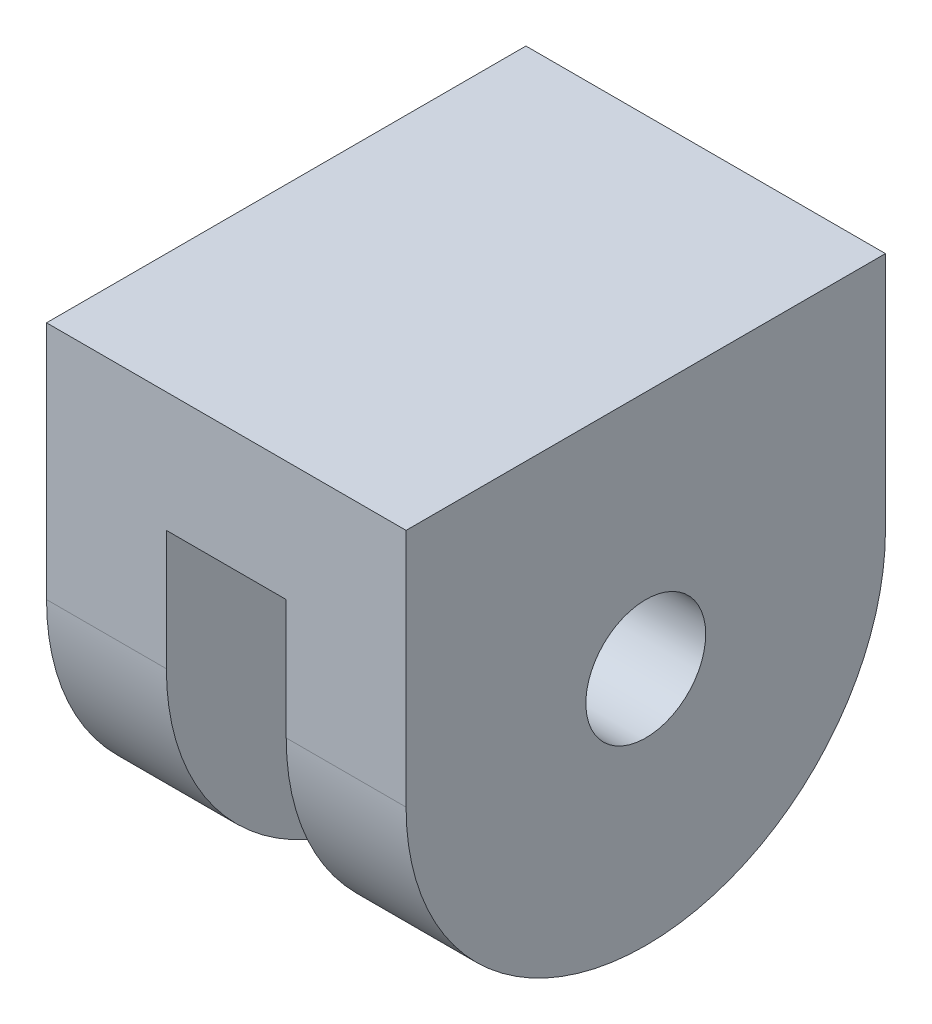
ISO-10303-21;
HEADER;
FILE_DESCRIPTION(('STEP AP214'),'2;1');
FILE_NAME('part.step','',(''),(''),'','','');
FILE_SCHEMA(('AUTOMOTIVE_DESIGN { 1 0 10303 214 1 1 1 1 }'));
ENDSEC;
DATA;
#1=APPLICATION_CONTEXT('core data for automotive mechanical design processes');
#2=APPLICATION_PROTOCOL_DEFINITION('international standard','automotive_design',2000,#1);
#3=PRODUCT_CONTEXT('',#1,'mechanical');
#4=PRODUCT('Part','Part','',(#3));
#5=PRODUCT_RELATED_PRODUCT_CATEGORY('part','',(#4));
#6=PRODUCT_DEFINITION_FORMATION('','',#4);
#7=PRODUCT_DEFINITION_CONTEXT('part definition',#1,'design');
#8=PRODUCT_DEFINITION('design','',#6,#7);
#9=PRODUCT_DEFINITION_SHAPE('','',#8);
#10=(LENGTH_UNIT() NAMED_UNIT(*) SI_UNIT(.MILLI.,.METRE.));
#11=(NAMED_UNIT(*) PLANE_ANGLE_UNIT() SI_UNIT($,.RADIAN.));
#12=(NAMED_UNIT(*) SI_UNIT($,.STERADIAN.) SOLID_ANGLE_UNIT());
#13=UNCERTAINTY_MEASURE_WITH_UNIT(LENGTH_MEASURE(1.E-05),#10,'distance_accuracy_value','');
#14=(GEOMETRIC_REPRESENTATION_CONTEXT(3) GLOBAL_UNCERTAINTY_ASSIGNED_CONTEXT((#13)) GLOBAL_UNIT_ASSIGNED_CONTEXT((#10,
#11,#12)) REPRESENTATION_CONTEXT('',''));
#15=CARTESIAN_POINT('',(0.,0.,0.));
#16=DIRECTION('',(0.,0.,1.));
#17=DIRECTION('',(1.,0.,0.));
#18=AXIS2_PLACEMENT_3D('',#15,#16,#17);
#19=CARTESIAN_POINT('',(9.525,-12.7,0.));
#20=DIRECTION('',(-1.,0.,0.));
#21=DIRECTION('',(0.,0.,1.));
#22=AXIS2_PLACEMENT_3D('',#19,#20,#21);
#23=CYLINDRICAL_SURFACE('',#22,12.7);
#24=DIRECTION('',(-1.,0.,0.));
#25=VECTOR('',#24,1.);
#26=CARTESIAN_POINT('',(9.525,-12.7,12.7));
#27=LINE('',#26,#25);
#28=CARTESIAN_POINT('',(9.525,-12.7,12.7));
#29=VERTEX_POINT('',#28);
#30=CARTESIAN_POINT('',(3.175,-12.7,12.7));
#31=VERTEX_POINT('',#30);
#32=EDGE_CURVE('E165',#29,#31,#27,.T.);
#33=ORIENTED_EDGE('',*,*,#32,.T.);
#34=CARTESIAN_POINT('',(3.175,-12.7,0.));
#35=DIRECTION('',(1.,0.,0.));
#36=DIRECTION('',(0.,0.,-1.));
#37=AXIS2_PLACEMENT_3D('',#34,#35,#36);
#38=CIRCLE('',#37,12.7);
#39=CARTESIAN_POINT('',(3.175,-12.7,-12.7));
#40=VERTEX_POINT('',#39);
#41=EDGE_CURVE('E114',#31,#40,#38,.T.);
#42=ORIENTED_EDGE('',*,*,#41,.T.);
#43=DIRECTION('',(-1.,0.,0.));
#44=VECTOR('',#43,1.);
#45=CARTESIAN_POINT('',(9.525,-12.7,-12.7));
#46=LINE('',#45,#44);
#47=CARTESIAN_POINT('',(9.525,-12.7,-12.7));
#48=VERTEX_POINT('',#47);
#49=EDGE_CURVE('E161',#48,#40,#46,.T.);
#50=ORIENTED_EDGE('',*,*,#49,.F.);
#51=CARTESIAN_POINT('',(9.525,-12.7,0.));
#52=DIRECTION('',(1.,0.,0.));
#53=DIRECTION('',(0.,0.,-1.));
#54=AXIS2_PLACEMENT_3D('',#51,#52,#53);
#55=CIRCLE('',#54,12.7);
#56=EDGE_CURVE('E146',#29,#48,#55,.T.);
#57=ORIENTED_EDGE('',*,*,#56,.F.);
#58=EDGE_LOOP('',(#33,#42,#50,#57));
#59=FACE_BOUND('',#58,.T.);
#60=ADVANCED_FACE('F34',(#59),#23,.T.);
#61=CARTESIAN_POINT('',(9.525,0.,12.7));
#62=DIRECTION('',(0.,-1.,0.));
#63=DIRECTION('',(0.,0.,-1.));
#64=AXIS2_PLACEMENT_3D('',#61,#62,#63);
#65=PLANE('',#64);
#66=DIRECTION('',(0.,0.,1.));
#67=VECTOR('',#66,1.);
#68=CARTESIAN_POINT('',(-9.525,0.,12.7));
#69=LINE('',#68,#67);
#70=CARTESIAN_POINT('',(-9.525,0.,-12.7));
#71=VERTEX_POINT('',#70);
#72=CARTESIAN_POINT('',(-9.525,0.,12.7));
#73=VERTEX_POINT('',#72);
#74=EDGE_CURVE('E142',#71,#73,#69,.T.);
#75=ORIENTED_EDGE('',*,*,#74,.T.);
#76=DIRECTION('',(-1.,0.,0.));
#77=VECTOR('',#76,1.);
#78=CARTESIAN_POINT('',(9.525,0.,12.7));
#79=LINE('',#78,#77);
#80=CARTESIAN_POINT('',(9.525,0.,12.7));
#81=VERTEX_POINT('',#80);
#82=EDGE_CURVE('E43',#81,#73,#79,.T.);
#83=ORIENTED_EDGE('',*,*,#82,.F.);
#84=DIRECTION('',(0.,0.,1.));
#85=VECTOR('',#84,1.);
#86=CARTESIAN_POINT('',(9.525,0.,12.7));
#87=LINE('',#86,#85);
#88=CARTESIAN_POINT('',(9.525,0.,-12.7));
#89=VERTEX_POINT('',#88);
#90=EDGE_CURVE('E143',#89,#81,#87,.T.);
#91=ORIENTED_EDGE('',*,*,#90,.F.);
#92=DIRECTION('',(-1.,0.,0.));
#93=VECTOR('',#92,1.);
#94=CARTESIAN_POINT('',(9.525,0.,-12.7));
#95=LINE('',#94,#93);
#96=EDGE_CURVE('E149',#89,#71,#95,.T.);
#97=ORIENTED_EDGE('',*,*,#96,.T.);
#98=EDGE_LOOP('',(#75,#83,#91,#97));
#99=FACE_BOUND('',#98,.T.);
#100=ADVANCED_FACE('F36',(#99),#65,.F.);
#101=CARTESIAN_POINT('',(9.525,0.,12.7));
#102=DIRECTION('',(0.,0.,-1.));
#103=DIRECTION('',(-1.,0.,0.));
#104=AXIS2_PLACEMENT_3D('',#101,#102,#103);
#105=PLANE('',#104);
#106=DIRECTION('',(-1.,0.,0.));
#107=VECTOR('',#106,1.);
#108=CARTESIAN_POINT('',(-3.175,-6.35,12.7));
#109=LINE('',#108,#107);
#110=CARTESIAN_POINT('',(3.175,-6.35,12.7));
#111=VERTEX_POINT('',#110);
#112=CARTESIAN_POINT('',(-3.175,-6.35,12.7));
#113=VERTEX_POINT('',#112);
#114=EDGE_CURVE('E117',#111,#113,#109,.T.);
#115=ORIENTED_EDGE('',*,*,#114,.F.);
#116=DIRECTION('',(0.,1.,0.));
#117=VECTOR('',#116,1.);
#118=CARTESIAN_POINT('',(3.175,-25.4,12.7));
#119=LINE('',#118,#117);
#120=EDGE_CURVE('E108',#31,#111,#119,.T.);
#121=ORIENTED_EDGE('',*,*,#120,.F.);
#122=ORIENTED_EDGE('',*,*,#32,.F.);
#123=DIRECTION('',(0.,-1.,0.));
#124=VECTOR('',#123,1.);
#125=CARTESIAN_POINT('',(9.525,0.,12.7));
#126=LINE('',#125,#124);
#127=EDGE_CURVE('E87',#81,#29,#126,.T.);
#128=ORIENTED_EDGE('',*,*,#127,.F.);
#129=ORIENTED_EDGE('',*,*,#82,.T.);
#130=DIRECTION('',(0.,-1.,0.));
#131=VECTOR('',#130,1.);
#132=CARTESIAN_POINT('',(-9.525,0.,12.7));
#133=LINE('',#132,#131);
#134=CARTESIAN_POINT('',(-9.525,-12.7,12.7));
#135=VERTEX_POINT('',#134);
#136=EDGE_CURVE('E152',#73,#135,#133,.T.);
#137=ORIENTED_EDGE('',*,*,#136,.T.);
#138=CARTESIAN_POINT('',(-3.175,-12.7,12.7));
#139=VERTEX_POINT('',#138);
#140=EDGE_CURVE('E164',#139,#135,#27,.T.);
#141=ORIENTED_EDGE('',*,*,#140,.F.);
#142=DIRECTION('',(0.,-1.,0.));
#143=VECTOR('',#142,1.);
#144=CARTESIAN_POINT('',(-3.175,-25.4,12.7));
#145=LINE('',#144,#143);
#146=EDGE_CURVE('E131',#113,#139,#145,.T.);
#147=ORIENTED_EDGE('',*,*,#146,.F.);
#148=EDGE_LOOP('',(#115,#121,#122,#128,#129,#137,#141,#147));
#149=FACE_BOUND('',#148,.T.);
#150=ADVANCED_FACE('F128',(#149),#105,.F.);
#151=CARTESIAN_POINT('',(-3.175,-12.7,-12.7));
#152=VERTEX_POINT('',#151);
#153=CARTESIAN_POINT('',(-9.525,-12.7,-12.7));
#154=VERTEX_POINT('',#153);
#155=EDGE_CURVE('E160',#152,#154,#46,.T.);
#156=ORIENTED_EDGE('',*,*,#155,.F.);
#157=CARTESIAN_POINT('',(-3.175,-12.7,0.));
#158=DIRECTION('',(-1.,0.,0.));
#159=DIRECTION('',(0.,0.,1.));
#160=AXIS2_PLACEMENT_3D('',#157,#158,#159);
#161=CIRCLE('',#160,12.7);
#162=EDGE_CURVE('E138',#152,#139,#161,.T.);
#163=ORIENTED_EDGE('',*,*,#162,.T.);
#164=ORIENTED_EDGE('',*,*,#140,.T.);
#165=CARTESIAN_POINT('',(-9.525,-12.7,0.));
#166=DIRECTION('',(1.,0.,0.));
#167=DIRECTION('',(0.,0.,-1.));
#168=AXIS2_PLACEMENT_3D('',#165,#166,#167);
#169=CIRCLE('',#168,12.7);
#170=EDGE_CURVE('E155',#135,#154,#169,.T.);
#171=ORIENTED_EDGE('',*,*,#170,.T.);
#172=EDGE_LOOP('',(#156,#163,#164,#171));
#173=FACE_BOUND('',#172,.T.);
#174=ADVANCED_FACE('F176',(#173),#23,.T.);
#175=CARTESIAN_POINT('',(9.525,0.,-12.7));
#176=DIRECTION('',(0.,0.,1.));
#177=DIRECTION('',(0.,-1.,0.));
#178=AXIS2_PLACEMENT_3D('',#175,#176,#177);
#179=PLANE('',#178);
#180=ORIENTED_EDGE('',*,*,#49,.T.);
#181=DIRECTION('',(0.,1.,0.));
#182=VECTOR('',#181,1.);
#183=CARTESIAN_POINT('',(3.175,0.,-12.7));
#184=LINE('',#183,#182);
#185=CARTESIAN_POINT('',(3.175,-6.35,-12.7));
#186=VERTEX_POINT('',#185);
#187=EDGE_CURVE('E11',#40,#186,#184,.T.);
#188=ORIENTED_EDGE('',*,*,#187,.T.);
#189=DIRECTION('',(-1.,0.,0.));
#190=VECTOR('',#189,1.);
#191=CARTESIAN_POINT('',(-3.175,-6.35,-12.7));
#192=LINE('',#191,#190);
#193=CARTESIAN_POINT('',(-3.175,-6.35,-12.7));
#194=VERTEX_POINT('',#193);
#195=EDGE_CURVE('E125',#186,#194,#192,.T.);
#196=ORIENTED_EDGE('',*,*,#195,.T.);
#197=DIRECTION('',(0.,-1.,0.));
#198=VECTOR('',#197,1.);
#199=CARTESIAN_POINT('',(-3.175,-25.4,-12.7));
#200=LINE('',#199,#198);
#201=EDGE_CURVE('E50',#194,#152,#200,.T.);
#202=ORIENTED_EDGE('',*,*,#201,.T.);
#203=ORIENTED_EDGE('',*,*,#155,.T.);
#204=DIRECTION('',(0.,1.,0.));
#205=VECTOR('',#204,1.);
#206=CARTESIAN_POINT('',(-9.525,0.,-12.7));
#207=LINE('',#206,#205);
#208=EDGE_CURVE('E79',#154,#71,#207,.T.);
#209=ORIENTED_EDGE('',*,*,#208,.T.);
#210=ORIENTED_EDGE('',*,*,#96,.F.);
#211=DIRECTION('',(0.,1.,0.));
#212=VECTOR('',#211,1.);
#213=CARTESIAN_POINT('',(9.525,0.,-12.7));
#214=LINE('',#213,#212);
#215=EDGE_CURVE('E59',#48,#89,#214,.T.);
#216=ORIENTED_EDGE('',*,*,#215,.F.);
#217=EDGE_LOOP('',(#180,#188,#196,#202,#203,#209,#210,#216));
#218=FACE_BOUND('',#217,.T.);
#219=ADVANCED_FACE('F178',(#218),#179,.F.);
#220=CARTESIAN_POINT('',(9.525,-12.7,0.));
#221=DIRECTION('',(1.,0.,0.));
#222=DIRECTION('',(0.,0.,-1.));
#223=AXIS2_PLACEMENT_3D('',#220,#221,#222);
#224=PLANE('',#223);
#225=CARTESIAN_POINT('',(9.525,-12.7,0.));
#226=DIRECTION('',(1.,0.,0.));
#227=DIRECTION('',(0.,0.,-1.));
#228=AXIS2_PLACEMENT_3D('',#225,#226,#227);
#229=CIRCLE('',#228,3.175);
#230=CARTESIAN_POINT('',(9.525,-12.7,-3.175));
#231=VERTEX_POINT('',#230);
#232=EDGE_CURVE('E286',#231,#231,#229,.T.);
#233=ORIENTED_EDGE('',*,*,#232,.F.);
#234=EDGE_LOOP('',(#233));
#235=FACE_BOUND('',#234,.T.);
#236=ORIENTED_EDGE('',*,*,#90,.T.);
#237=ORIENTED_EDGE('',*,*,#127,.T.);
#238=ORIENTED_EDGE('',*,*,#56,.T.);
#239=ORIENTED_EDGE('',*,*,#215,.T.);
#240=EDGE_LOOP('',(#236,#237,#238,#239));
#241=FACE_BOUND('',#240,.T.);
#242=ADVANCED_FACE('F182',(#235,#241),#224,.T.);
#243=CARTESIAN_POINT('',(-9.525,-12.7,0.));
#244=DIRECTION('',(1.,0.,0.));
#245=DIRECTION('',(0.,0.,-1.));
#246=AXIS2_PLACEMENT_3D('',#243,#244,#245);
#247=PLANE('',#246);
#248=CARTESIAN_POINT('',(-9.525,-12.7,0.));
#249=DIRECTION('',(1.,0.,0.));
#250=DIRECTION('',(0.,0.,-1.));
#251=AXIS2_PLACEMENT_3D('',#248,#249,#250);
#252=CIRCLE('',#251,3.175);
#253=CARTESIAN_POINT('',(-9.525,-12.7,-3.175));
#254=VERTEX_POINT('',#253);
#255=EDGE_CURVE('E290',#254,#254,#252,.T.);
#256=ORIENTED_EDGE('',*,*,#255,.T.);
#257=EDGE_LOOP('',(#256));
#258=FACE_BOUND('',#257,.T.);
#259=ORIENTED_EDGE('',*,*,#74,.F.);
#260=ORIENTED_EDGE('',*,*,#208,.F.);
#261=ORIENTED_EDGE('',*,*,#170,.F.);
#262=ORIENTED_EDGE('',*,*,#136,.F.);
#263=EDGE_LOOP('',(#259,#260,#261,#262));
#264=FACE_BOUND('',#263,.T.);
#265=ADVANCED_FACE('F173',(#258,#264),#247,.F.);
#266=CARTESIAN_POINT('',(3.175,-25.4,-12.7));
#267=DIRECTION('',(1.,0.,0.));
#268=DIRECTION('',(0.,0.,-1.));
#269=AXIS2_PLACEMENT_3D('',#266,#267,#268);
#270=PLANE('',#269);
#271=CARTESIAN_POINT('',(3.175,-12.7,0.));
#272=DIRECTION('',(1.,0.,0.));
#273=DIRECTION('',(0.,0.,-1.));
#274=AXIS2_PLACEMENT_3D('',#271,#272,#273);
#275=CIRCLE('',#274,3.175);
#276=CARTESIAN_POINT('',(3.175,-12.7,-3.175));
#277=VERTEX_POINT('',#276);
#278=EDGE_CURVE('E118',#277,#277,#275,.T.);
#279=ORIENTED_EDGE('',*,*,#278,.T.);
#280=EDGE_LOOP('',(#279));
#281=FACE_BOUND('',#280,.T.);
#282=ORIENTED_EDGE('',*,*,#120,.T.);
#283=DIRECTION('',(0.,0.,1.));
#284=VECTOR('',#283,1.);
#285=CARTESIAN_POINT('',(3.175,-6.35,-12.7));
#286=LINE('',#285,#284);
#287=EDGE_CURVE('E112',#186,#111,#286,.T.);
#288=ORIENTED_EDGE('',*,*,#287,.F.);
#289=ORIENTED_EDGE('',*,*,#187,.F.);
#290=ORIENTED_EDGE('',*,*,#41,.F.);
#291=EDGE_LOOP('',(#282,#288,#289,#290));
#292=FACE_BOUND('',#291,.T.);
#293=ADVANCED_FACE('F110',(#281,#292),#270,.F.);
#294=CARTESIAN_POINT('',(-3.175,-25.4,-12.7));
#295=DIRECTION('',(-1.,0.,0.));
#296=DIRECTION('',(0.,0.,1.));
#297=AXIS2_PLACEMENT_3D('',#294,#295,#296);
#298=PLANE('',#297);
#299=CARTESIAN_POINT('',(-3.175,-12.7,0.));
#300=DIRECTION('',(-1.,0.,0.));
#301=DIRECTION('',(0.,0.,1.));
#302=AXIS2_PLACEMENT_3D('',#299,#300,#301);
#303=CIRCLE('',#302,3.175);
#304=CARTESIAN_POINT('',(-3.175,-12.7,3.175));
#305=VERTEX_POINT('',#304);
#306=EDGE_CURVE('E38',#305,#305,#303,.T.);
#307=ORIENTED_EDGE('',*,*,#306,.T.);
#308=EDGE_LOOP('',(#307));
#309=FACE_BOUND('',#308,.T.);
#310=ORIENTED_EDGE('',*,*,#201,.F.);
#311=DIRECTION('',(0.,0.,1.));
#312=VECTOR('',#311,1.);
#313=CARTESIAN_POINT('',(-3.175,-6.35,-12.7));
#314=LINE('',#313,#312);
#315=EDGE_CURVE('E126',#194,#113,#314,.T.);
#316=ORIENTED_EDGE('',*,*,#315,.T.);
#317=ORIENTED_EDGE('',*,*,#146,.T.);
#318=ORIENTED_EDGE('',*,*,#162,.F.);
#319=EDGE_LOOP('',(#310,#316,#317,#318));
#320=FACE_BOUND('',#319,.T.);
#321=ADVANCED_FACE('F177',(#309,#320),#298,.F.);
#322=CARTESIAN_POINT('',(-3.175,-6.35,-12.7));
#323=DIRECTION('',(0.,1.,0.));
#324=DIRECTION('',(0.,0.,1.));
#325=AXIS2_PLACEMENT_3D('',#322,#323,#324);
#326=PLANE('',#325);
#327=ORIENTED_EDGE('',*,*,#315,.F.);
#328=ORIENTED_EDGE('',*,*,#195,.F.);
#329=ORIENTED_EDGE('',*,*,#287,.T.);
#330=ORIENTED_EDGE('',*,*,#114,.T.);
#331=EDGE_LOOP('',(#327,#328,#329,#330));
#332=FACE_BOUND('',#331,.T.);
#333=ADVANCED_FACE('F122',(#332),#326,.F.);
#334=CARTESIAN_POINT('',(-9.525,-12.7,0.));
#335=DIRECTION('',(1.,0.,0.));
#336=DIRECTION('',(0.,0.,-1.));
#337=AXIS2_PLACEMENT_3D('',#334,#335,#336);
#338=CYLINDRICAL_SURFACE('',#337,3.175);
#339=ORIENTED_EDGE('',*,*,#255,.F.);
#340=EDGE_LOOP('',(#339));
#341=FACE_BOUND('',#340,.T.);
#342=ORIENTED_EDGE('',*,*,#306,.F.);
#343=EDGE_LOOP('',(#342));
#344=FACE_BOUND('',#343,.T.);
#345=ADVANCED_FACE('F245',(#341,#344),#338,.F.);
#346=ORIENTED_EDGE('',*,*,#232,.T.);
#347=EDGE_LOOP('',(#346));
#348=FACE_BOUND('',#347,.T.);
#349=ORIENTED_EDGE('',*,*,#278,.F.);
#350=EDGE_LOOP('',(#349));
#351=FACE_BOUND('',#350,.T.);
#352=ADVANCED_FACE('F253',(#348,#351),#338,.F.);
#353=CLOSED_SHELL('',(#60,#100,#150,#174,#219,#242,#265,#293,#321,#333,#345,#352));
#354=MANIFOLD_SOLID_BREP('B2',#353);
#355=ADVANCED_BREP_SHAPE_REPRESENTATION('',(#18,#354),#14);
#356=SHAPE_DEFINITION_REPRESENTATION(#9,#355);
ENDSEC;
END-ISO-10303-21;
